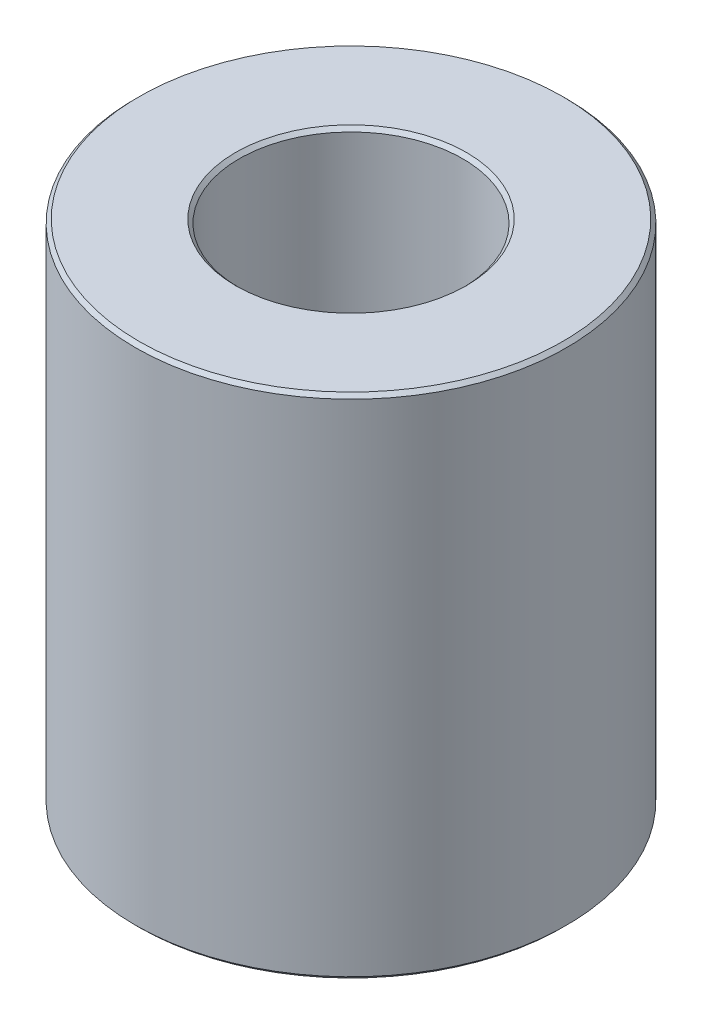
ISO-10303-21;
HEADER;
FILE_DESCRIPTION(('STEP AP214'),'2;1');
FILE_NAME('part.step','',(''),(''),'','','');
FILE_SCHEMA(('AUTOMOTIVE_DESIGN { 1 0 10303 214 1 1 1 1 }'));
ENDSEC;
DATA;
#1=APPLICATION_CONTEXT('core data for automotive mechanical design processes');
#2=APPLICATION_PROTOCOL_DEFINITION('international standard','automotive_design',2000,#1);
#3=PRODUCT_CONTEXT('',#1,'mechanical');
#4=PRODUCT('Part','Part','',(#3));
#5=PRODUCT_RELATED_PRODUCT_CATEGORY('part','',(#4));
#6=PRODUCT_DEFINITION_FORMATION('','',#4);
#7=PRODUCT_DEFINITION_CONTEXT('part definition',#1,'design');
#8=PRODUCT_DEFINITION('design','',#6,#7);
#9=PRODUCT_DEFINITION_SHAPE('','',#8);
#10=(LENGTH_UNIT() NAMED_UNIT(*) SI_UNIT(.MILLI.,.METRE.));
#11=(NAMED_UNIT(*) PLANE_ANGLE_UNIT() SI_UNIT($,.RADIAN.));
#12=(NAMED_UNIT(*) SI_UNIT($,.STERADIAN.) SOLID_ANGLE_UNIT());
#13=UNCERTAINTY_MEASURE_WITH_UNIT(LENGTH_MEASURE(1.E-05),#10,'distance_accuracy_value','');
#14=(GEOMETRIC_REPRESENTATION_CONTEXT(3) GLOBAL_UNCERTAINTY_ASSIGNED_CONTEXT((#13)) GLOBAL_UNIT_ASSIGNED_CONTEXT((#10,
#11,#12)) REPRESENTATION_CONTEXT('',''));
#15=CARTESIAN_POINT('',(0.,0.,0.));
#16=DIRECTION('',(0.,0.,1.));
#17=DIRECTION('',(1.,0.,0.));
#18=AXIS2_PLACEMENT_3D('',#15,#16,#17);
#19=CARTESIAN_POINT('',(0.,100.032803976234,0.));
#20=DIRECTION('',(0.,-1.,0.));
#21=DIRECTION('',(0.,0.,-1.));
#22=AXIS2_PLACEMENT_3D('',#19,#20,#21);
#23=CYLINDRICAL_SURFACE('',#22,42.5);
#24=CARTESIAN_POINT('',(0.,0.716584075814194,0.));
#25=DIRECTION('',(0.,1.,0.));
#26=DIRECTION('',(0.,0.,1.));
#27=AXIS2_PLACEMENT_3D('',#24,#25,#26);
#28=CIRCLE('',#27,42.5);
#29=CARTESIAN_POINT('',(0.,0.716584075814194,42.5));
#30=VERTEX_POINT('',#29);
#31=EDGE_CURVE('E10',#30,#30,#28,.T.);
#32=ORIENTED_EDGE('',*,*,#31,.T.);
#33=EDGE_LOOP('',(#32));
#34=FACE_BOUND('',#33,.T.);
#35=CARTESIAN_POINT('',(0.,99.3162199004199,0.));
#36=DIRECTION('',(0.,1.,0.));
#37=DIRECTION('',(0.,0.,1.));
#38=AXIS2_PLACEMENT_3D('',#35,#36,#37);
#39=CIRCLE('',#38,42.5);
#40=CARTESIAN_POINT('',(0.,99.3162199004199,42.5));
#41=VERTEX_POINT('',#40);
#42=EDGE_CURVE('E50',#41,#41,#39,.F.);
#43=ORIENTED_EDGE('',*,*,#42,.T.);
#44=EDGE_LOOP('',(#43));
#45=FACE_BOUND('',#44,.T.);
#46=ADVANCED_FACE('F39',(#34,#45),#23,.T.);
#47=CARTESIAN_POINT('',(0.,100.032803976234,0.));
#48=DIRECTION('',(0.,1.,0.));
#49=DIRECTION('',(0.,0.,1.));
#50=AXIS2_PLACEMENT_3D('',#47,#48,#49);
#51=PLANE('',#50);
#52=CARTESIAN_POINT('',(0.,100.032803976234,0.));
#53=DIRECTION('',(0.,1.,0.));
#54=DIRECTION('',(0.,0.,1.));
#55=AXIS2_PLACEMENT_3D('',#52,#53,#54);
#56=CIRCLE('',#55,22.7544150028034);
#57=CARTESIAN_POINT('',(0.,100.032803976234,22.7544150028034));
#58=VERTEX_POINT('',#57);
#59=EDGE_CURVE('E58',#58,#58,#56,.F.);
#60=ORIENTED_EDGE('',*,*,#59,.T.);
#61=EDGE_LOOP('',(#60));
#62=FACE_BOUND('',#61,.T.);
#63=CARTESIAN_POINT('',(0.,100.032803976234,0.));
#64=DIRECTION('',(0.,1.,0.));
#65=DIRECTION('',(0.,0.,1.));
#66=AXIS2_PLACEMENT_3D('',#63,#64,#65);
#67=CIRCLE('',#66,41.7834159241858);
#68=CARTESIAN_POINT('',(0.,100.032803976234,41.7834159241858));
#69=VERTEX_POINT('',#68);
#70=EDGE_CURVE('E61',#69,#69,#67,.T.);
#71=ORIENTED_EDGE('',*,*,#70,.T.);
#72=EDGE_LOOP('',(#71));
#73=FACE_BOUND('',#72,.T.);
#74=ADVANCED_FACE('F88',(#62,#73),#51,.T.);
#75=CARTESIAN_POINT('',(0.,0.,0.));
#76=DIRECTION('',(0.,1.,0.));
#77=DIRECTION('',(0.,0.,1.));
#78=AXIS2_PLACEMENT_3D('',#75,#76,#77);
#79=PLANE('',#78);
#80=CARTESIAN_POINT('',(0.,0.,0.));
#81=DIRECTION('',(0.,1.,0.));
#82=DIRECTION('',(0.,0.,1.));
#83=AXIS2_PLACEMENT_3D('',#80,#81,#82);
#84=CIRCLE('',#83,22.7544150028034);
#85=CARTESIAN_POINT('',(0.,0.,22.7544150028034));
#86=VERTEX_POINT('',#85);
#87=EDGE_CURVE('E51',#86,#86,#84,.T.);
#88=ORIENTED_EDGE('',*,*,#87,.T.);
#89=EDGE_LOOP('',(#88));
#90=FACE_BOUND('',#89,.T.);
#91=CARTESIAN_POINT('',(0.,0.,0.));
#92=DIRECTION('',(0.,1.,0.));
#93=DIRECTION('',(0.,0.,1.));
#94=AXIS2_PLACEMENT_3D('',#91,#92,#93);
#95=CIRCLE('',#94,41.7834159241858);
#96=CARTESIAN_POINT('',(0.,0.,41.7834159241858));
#97=VERTEX_POINT('',#96);
#98=EDGE_CURVE('E54',#97,#97,#95,.F.);
#99=ORIENTED_EDGE('',*,*,#98,.T.);
#100=EDGE_LOOP('',(#99));
#101=FACE_BOUND('',#100,.T.);
#102=ADVANCED_FACE('F83',(#90,#101),#79,.F.);
#103=CARTESIAN_POINT('',(0.,100.032803976234,0.));
#104=DIRECTION('',(0.,-1.,0.));
#105=DIRECTION('',(0.,0.,-1.));
#106=AXIS2_PLACEMENT_3D('',#103,#104,#105);
#107=CYLINDRICAL_SURFACE('',#106,22.0378309269892);
#108=CARTESIAN_POINT('',(0.,99.31621990042,0.));
#109=DIRECTION('',(0.,1.,0.));
#110=DIRECTION('',(0.,0.,1.));
#111=AXIS2_PLACEMENT_3D('',#108,#109,#110);
#112=CIRCLE('',#111,22.0378309269892);
#113=CARTESIAN_POINT('',(0.,99.31621990042,22.0378309269892));
#114=VERTEX_POINT('',#113);
#115=EDGE_CURVE('E67',#114,#114,#112,.T.);
#116=ORIENTED_EDGE('',*,*,#115,.T.);
#117=EDGE_LOOP('',(#116));
#118=FACE_BOUND('',#117,.T.);
#119=CARTESIAN_POINT('',(0.,0.716584075814208,0.));
#120=DIRECTION('',(0.,1.,0.));
#121=DIRECTION('',(0.,0.,1.));
#122=AXIS2_PLACEMENT_3D('',#119,#120,#121);
#123=CIRCLE('',#122,22.0378309269892);
#124=CARTESIAN_POINT('',(0.,0.716584075814208,22.0378309269892));
#125=VERTEX_POINT('',#124);
#126=EDGE_CURVE('E69',#125,#125,#123,.F.);
#127=ORIENTED_EDGE('',*,*,#126,.T.);
#128=EDGE_LOOP('',(#127));
#129=FACE_BOUND('',#128,.T.);
#130=ADVANCED_FACE('F71',(#118,#129),#107,.F.);
#131=CARTESIAN_POINT('',(0.,99.31621990042,0.));
#132=DIRECTION('',(0.,1.,0.));
#133=DIRECTION('',(0.,0.,1.));
#134=AXIS2_PLACEMENT_3D('',#131,#132,#133);
#135=CONICAL_SURFACE('',#134,22.0378309269892,0.785398163397453);
#136=ORIENTED_EDGE('',*,*,#59,.F.);
#137=EDGE_LOOP('',(#136));
#138=FACE_BOUND('',#137,.T.);
#139=ORIENTED_EDGE('',*,*,#115,.F.);
#140=EDGE_LOOP('',(#139));
#141=FACE_BOUND('',#140,.T.);
#142=ADVANCED_FACE('F77',(#138,#141),#135,.F.);
#143=CARTESIAN_POINT('',(0.,0.,0.));
#144=DIRECTION('',(0.,-1.,0.));
#145=DIRECTION('',(0.,0.,-1.));
#146=AXIS2_PLACEMENT_3D('',#143,#144,#145);
#147=CONICAL_SURFACE('',#146,22.7544150028034,0.785398163397443);
#148=ORIENTED_EDGE('',*,*,#126,.F.);
#149=EDGE_LOOP('',(#148));
#150=FACE_BOUND('',#149,.T.);
#151=ORIENTED_EDGE('',*,*,#87,.F.);
#152=EDGE_LOOP('',(#151));
#153=FACE_BOUND('',#152,.T.);
#154=ADVANCED_FACE('F73',(#150,#153),#147,.F.);
#155=CARTESIAN_POINT('',(0.,0.716584075814194,0.));
#156=DIRECTION('',(0.,1.,0.));
#157=DIRECTION('',(0.,0.,1.));
#158=AXIS2_PLACEMENT_3D('',#155,#156,#157);
#159=CONICAL_SURFACE('',#158,42.5,0.785398163397448);
#160=ORIENTED_EDGE('',*,*,#98,.F.);
#161=EDGE_LOOP('',(#160));
#162=FACE_BOUND('',#161,.T.);
#163=ORIENTED_EDGE('',*,*,#31,.F.);
#164=EDGE_LOOP('',(#163));
#165=FACE_BOUND('',#164,.T.);
#166=ADVANCED_FACE('F76',(#162,#165),#159,.T.);
#167=CARTESIAN_POINT('',(0.,100.032803976234,0.));
#168=DIRECTION('',(0.,-1.,0.));
#169=DIRECTION('',(0.,0.,-1.));
#170=AXIS2_PLACEMENT_3D('',#167,#168,#169);
#171=CONICAL_SURFACE('',#170,41.7834159241858,0.785398163397448);
#172=ORIENTED_EDGE('',*,*,#42,.F.);
#173=EDGE_LOOP('',(#172));
#174=FACE_BOUND('',#173,.T.);
#175=ORIENTED_EDGE('',*,*,#70,.F.);
#176=EDGE_LOOP('',(#175));
#177=FACE_BOUND('',#176,.T.);
#178=ADVANCED_FACE('F45',(#174,#177),#171,.T.);
#179=CLOSED_SHELL('',(#46,#74,#102,#130,#142,#154,#166,#178));
#180=MANIFOLD_SOLID_BREP('B2',#179);
#181=ADVANCED_BREP_SHAPE_REPRESENTATION('',(#18,#180),#14);
#182=SHAPE_DEFINITION_REPRESENTATION(#9,#181);
ENDSEC;
END-ISO-10303-21;
